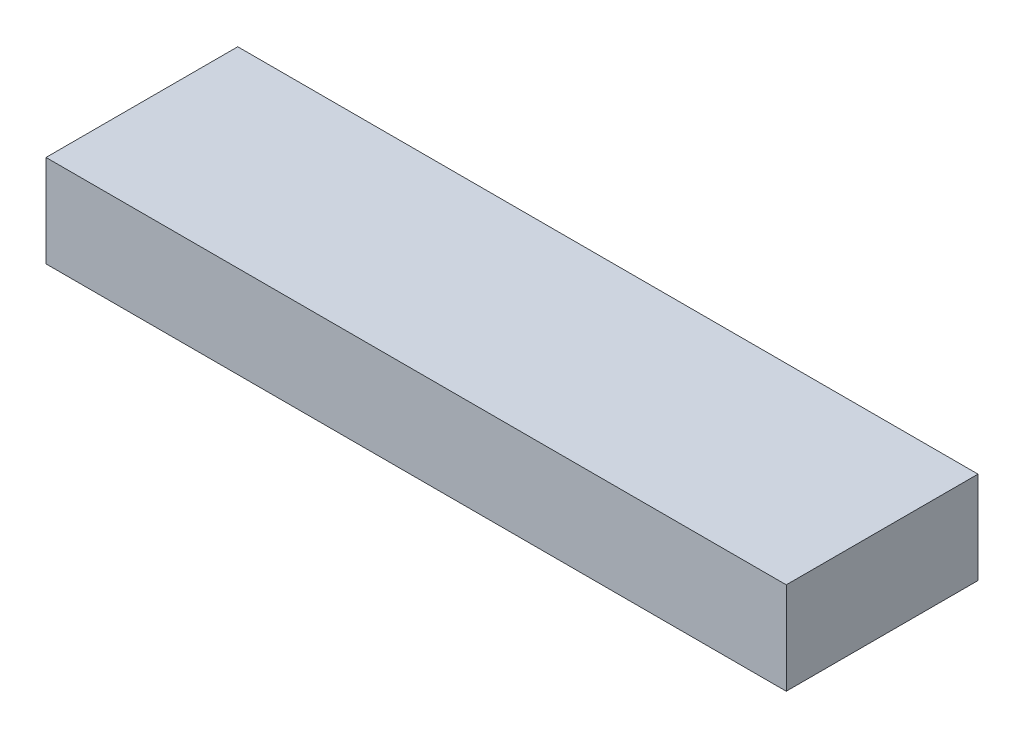
ISO-10303-21;
HEADER;
FILE_DESCRIPTION(('STEP AP214'),'2;1');
FILE_NAME('part.step','',(''),(''),'','','');
FILE_SCHEMA(('AUTOMOTIVE_DESIGN { 1 0 10303 214 1 1 1 1 }'));
ENDSEC;
DATA;
#1=APPLICATION_CONTEXT('core data for automotive mechanical design processes');
#2=APPLICATION_PROTOCOL_DEFINITION('international standard','automotive_design',2000,#1);
#3=PRODUCT_CONTEXT('',#1,'mechanical');
#4=PRODUCT('Part','Part','',(#3));
#5=PRODUCT_RELATED_PRODUCT_CATEGORY('part','',(#4));
#6=PRODUCT_DEFINITION_FORMATION('','',#4);
#7=PRODUCT_DEFINITION_CONTEXT('part definition',#1,'design');
#8=PRODUCT_DEFINITION('design','',#6,#7);
#9=PRODUCT_DEFINITION_SHAPE('','',#8);
#10=(LENGTH_UNIT() NAMED_UNIT(*) SI_UNIT(.MILLI.,.METRE.));
#11=(NAMED_UNIT(*) PLANE_ANGLE_UNIT() SI_UNIT($,.RADIAN.));
#12=(NAMED_UNIT(*) SI_UNIT($,.STERADIAN.) SOLID_ANGLE_UNIT());
#13=UNCERTAINTY_MEASURE_WITH_UNIT(LENGTH_MEASURE(1.E-05),#10,'distance_accuracy_value','');
#14=(GEOMETRIC_REPRESENTATION_CONTEXT(3) GLOBAL_UNCERTAINTY_ASSIGNED_CONTEXT((#13)) GLOBAL_UNIT_ASSIGNED_CONTEXT((#10,
#11,#12)) REPRESENTATION_CONTEXT('',''));
#15=CARTESIAN_POINT('',(0.,0.,0.));
#16=DIRECTION('',(0.,0.,1.));
#17=DIRECTION('',(1.,0.,0.));
#18=AXIS2_PLACEMENT_3D('',#15,#16,#17);
#19=CARTESIAN_POINT('',(-8.87483552635438,10.,-31.2885769347161));
#20=DIRECTION('',(-1.,0.,0.));
#21=DIRECTION('',(0.,0.,1.));
#22=AXIS2_PLACEMENT_3D('',#19,#20,#21);
#23=PLANE('',#22);
#24=DIRECTION('',(0.,0.,-1.));
#25=VECTOR('',#24,1.);
#26=CARTESIAN_POINT('',(-8.87483552635438,0.,-31.2885769347161));
#27=LINE('',#26,#25);
#28=CARTESIAN_POINT('',(-8.87483552635438,0.,-10.4885769347161));
#29=VERTEX_POINT('',#28);
#30=CARTESIAN_POINT('',(-8.87483552635438,0.,-31.2885769347161));
#31=VERTEX_POINT('',#30);
#32=EDGE_CURVE('E113',#29,#31,#27,.T.);
#33=ORIENTED_EDGE('',*,*,#32,.T.);
#34=DIRECTION('',(0.,-1.,0.));
#35=VECTOR('',#34,1.);
#36=CARTESIAN_POINT('',(-8.87483552635438,10.,-31.2885769347161));
#37=LINE('',#36,#35);
#38=CARTESIAN_POINT('',(-8.87483552635438,10.,-31.2885769347161));
#39=VERTEX_POINT('',#38);
#40=EDGE_CURVE('E11',#39,#31,#37,.T.);
#41=ORIENTED_EDGE('',*,*,#40,.F.);
#42=DIRECTION('',(0.,0.,-1.));
#43=VECTOR('',#42,1.);
#44=CARTESIAN_POINT('',(-8.87483552635438,10.,-31.2885769347161));
#45=LINE('',#44,#43);
#46=CARTESIAN_POINT('',(-8.87483552635438,10.,-10.4885769347161));
#47=VERTEX_POINT('',#46);
#48=EDGE_CURVE('E97',#47,#39,#45,.T.);
#49=ORIENTED_EDGE('',*,*,#48,.F.);
#50=DIRECTION('',(0.,-1.,0.));
#51=VECTOR('',#50,1.);
#52=CARTESIAN_POINT('',(-8.87483552635438,10.,-10.4885769347161));
#53=LINE('',#52,#51);
#54=EDGE_CURVE('E109',#47,#29,#53,.T.);
#55=ORIENTED_EDGE('',*,*,#54,.T.);
#56=EDGE_LOOP('',(#33,#41,#49,#55));
#57=FACE_BOUND('',#56,.T.);
#58=ADVANCED_FACE('F45',(#57),#23,.F.);
#59=CARTESIAN_POINT('',(-89.1748355263544,10.,-31.2885769347161));
#60=DIRECTION('',(0.,0.,1.));
#61=DIRECTION('',(1.,0.,0.));
#62=AXIS2_PLACEMENT_3D('',#59,#60,#61);
#63=PLANE('',#62);
#64=DIRECTION('',(-1.,0.,0.));
#65=VECTOR('',#64,1.);
#66=CARTESIAN_POINT('',(-89.1748355263544,0.,-31.2885769347161));
#67=LINE('',#66,#65);
#68=CARTESIAN_POINT('',(-89.1748355263544,0.,-31.2885769347161));
#69=VERTEX_POINT('',#68);
#70=EDGE_CURVE('E102',#31,#69,#67,.T.);
#71=ORIENTED_EDGE('',*,*,#70,.T.);
#72=DIRECTION('',(0.,-1.,0.));
#73=VECTOR('',#72,1.);
#74=CARTESIAN_POINT('',(-89.1748355263544,10.,-31.2885769347161));
#75=LINE('',#74,#73);
#76=CARTESIAN_POINT('',(-89.1748355263544,10.,-31.2885769347161));
#77=VERTEX_POINT('',#76);
#78=EDGE_CURVE('E54',#77,#69,#75,.T.);
#79=ORIENTED_EDGE('',*,*,#78,.F.);
#80=DIRECTION('',(-1.,0.,0.));
#81=VECTOR('',#80,1.);
#82=CARTESIAN_POINT('',(-89.1748355263544,10.,-31.2885769347161));
#83=LINE('',#82,#81);
#84=EDGE_CURVE('E92',#39,#77,#83,.T.);
#85=ORIENTED_EDGE('',*,*,#84,.F.);
#86=ORIENTED_EDGE('',*,*,#40,.T.);
#87=EDGE_LOOP('',(#71,#79,#85,#86));
#88=FACE_BOUND('',#87,.T.);
#89=ADVANCED_FACE('F101',(#88),#63,.F.);
#90=CARTESIAN_POINT('',(-89.1748355263544,10.,-31.2885769347161));
#91=DIRECTION('',(1.,0.,0.));
#92=DIRECTION('',(0.,0.,-1.));
#93=AXIS2_PLACEMENT_3D('',#90,#91,#92);
#94=PLANE('',#93);
#95=DIRECTION('',(0.,0.,1.));
#96=VECTOR('',#95,1.);
#97=CARTESIAN_POINT('',(-89.1748355263544,0.,-31.2885769347161));
#98=LINE('',#97,#96);
#99=CARTESIAN_POINT('',(-89.1748355263544,0.,-10.4885769347161));
#100=VERTEX_POINT('',#99);
#101=EDGE_CURVE('E79',#69,#100,#98,.T.);
#102=ORIENTED_EDGE('',*,*,#101,.T.);
#103=DIRECTION('',(0.,-1.,0.));
#104=VECTOR('',#103,1.);
#105=CARTESIAN_POINT('',(-89.1748355263544,10.,-10.4885769347161));
#106=LINE('',#105,#104);
#107=CARTESIAN_POINT('',(-89.1748355263544,10.,-10.4885769347161));
#108=VERTEX_POINT('',#107);
#109=EDGE_CURVE('E104',#108,#100,#106,.T.);
#110=ORIENTED_EDGE('',*,*,#109,.F.);
#111=DIRECTION('',(0.,0.,1.));
#112=VECTOR('',#111,1.);
#113=CARTESIAN_POINT('',(-89.1748355263544,10.,-31.2885769347161));
#114=LINE('',#113,#112);
#115=EDGE_CURVE('E95',#77,#108,#114,.T.);
#116=ORIENTED_EDGE('',*,*,#115,.F.);
#117=ORIENTED_EDGE('',*,*,#78,.T.);
#118=EDGE_LOOP('',(#102,#110,#116,#117));
#119=FACE_BOUND('',#118,.T.);
#120=ADVANCED_FACE('F105',(#119),#94,.F.);
#121=CARTESIAN_POINT('',(-89.1748355263544,10.,-10.4885769347161));
#122=DIRECTION('',(0.,0.,-1.));
#123=DIRECTION('',(-1.,0.,0.));
#124=AXIS2_PLACEMENT_3D('',#121,#122,#123);
#125=PLANE('',#124);
#126=DIRECTION('',(1.,0.,0.));
#127=VECTOR('',#126,1.);
#128=CARTESIAN_POINT('',(-89.1748355263544,0.,-10.4885769347161));
#129=LINE('',#128,#127);
#130=EDGE_CURVE('E85',#100,#29,#129,.T.);
#131=ORIENTED_EDGE('',*,*,#130,.T.);
#132=ORIENTED_EDGE('',*,*,#54,.F.);
#133=DIRECTION('',(1.,0.,0.));
#134=VECTOR('',#133,1.);
#135=CARTESIAN_POINT('',(-89.1748355263544,10.,-10.4885769347161));
#136=LINE('',#135,#134);
#137=EDGE_CURVE('E62',#108,#47,#136,.T.);
#138=ORIENTED_EDGE('',*,*,#137,.F.);
#139=ORIENTED_EDGE('',*,*,#109,.T.);
#140=EDGE_LOOP('',(#131,#132,#138,#139));
#141=FACE_BOUND('',#140,.T.);
#142=ADVANCED_FACE('F126',(#141),#125,.F.);
#143=CARTESIAN_POINT('',(0.,10.,0.));
#144=DIRECTION('',(0.,1.,0.));
#145=DIRECTION('',(0.,0.,1.));
#146=AXIS2_PLACEMENT_3D('',#143,#144,#145);
#147=PLANE('',#146);
#148=ORIENTED_EDGE('',*,*,#48,.T.);
#149=ORIENTED_EDGE('',*,*,#84,.T.);
#150=ORIENTED_EDGE('',*,*,#115,.T.);
#151=ORIENTED_EDGE('',*,*,#137,.T.);
#152=EDGE_LOOP('',(#148,#149,#150,#151));
#153=FACE_BOUND('',#152,.T.);
#154=ADVANCED_FACE('F93',(#153),#147,.T.);
#155=CARTESIAN_POINT('',(0.,0.,0.));
#156=DIRECTION('',(0.,1.,0.));
#157=DIRECTION('',(0.,0.,1.));
#158=AXIS2_PLACEMENT_3D('',#155,#156,#157);
#159=PLANE('',#158);
#160=ORIENTED_EDGE('',*,*,#32,.F.);
#161=ORIENTED_EDGE('',*,*,#130,.F.);
#162=ORIENTED_EDGE('',*,*,#101,.F.);
#163=ORIENTED_EDGE('',*,*,#70,.F.);
#164=EDGE_LOOP('',(#160,#161,#162,#163));
#165=FACE_BOUND('',#164,.T.);
#166=ADVANCED_FACE('F129',(#165),#159,.F.);
#167=CLOSED_SHELL('',(#58,#89,#120,#142,#154,#166));
#168=MANIFOLD_SOLID_BREP('B2',#167);
#169=ADVANCED_BREP_SHAPE_REPRESENTATION('',(#18,#168),#14);
#170=SHAPE_DEFINITION_REPRESENTATION(#9,#169);
ENDSEC;
END-ISO-10303-21;
